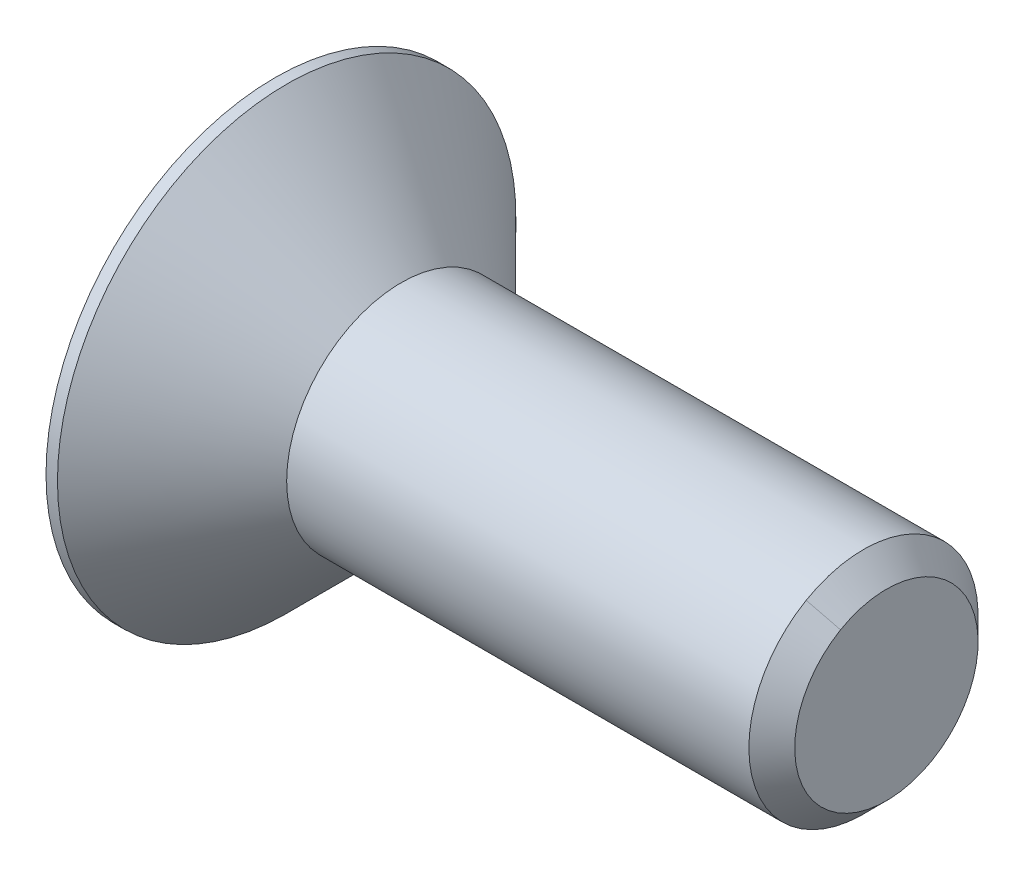
ISO-10303-21;
HEADER;
FILE_DESCRIPTION(('STEP AP214'),'2;1');
FILE_NAME('part.step','',(''),(''),'','','');
FILE_SCHEMA(('AUTOMOTIVE_DESIGN { 1 0 10303 214 1 1 1 1 }'));
ENDSEC;
DATA;
#1=APPLICATION_CONTEXT('core data for automotive mechanical design processes');
#2=APPLICATION_PROTOCOL_DEFINITION('international standard','automotive_design',2000,#1);
#3=PRODUCT_CONTEXT('',#1,'mechanical');
#4=PRODUCT('Part','Part','',(#3));
#5=PRODUCT_RELATED_PRODUCT_CATEGORY('part','',(#4));
#6=PRODUCT_DEFINITION_FORMATION('','',#4);
#7=PRODUCT_DEFINITION_CONTEXT('part definition',#1,'design');
#8=PRODUCT_DEFINITION('design','',#6,#7);
#9=PRODUCT_DEFINITION_SHAPE('','',#8);
#10=(LENGTH_UNIT() NAMED_UNIT(*) SI_UNIT(.MILLI.,.METRE.));
#11=(NAMED_UNIT(*) PLANE_ANGLE_UNIT() SI_UNIT($,.RADIAN.));
#12=(NAMED_UNIT(*) SI_UNIT($,.STERADIAN.) SOLID_ANGLE_UNIT());
#13=UNCERTAINTY_MEASURE_WITH_UNIT(LENGTH_MEASURE(1.E-05),#10,'distance_accuracy_value','');
#14=(GEOMETRIC_REPRESENTATION_CONTEXT(3) GLOBAL_UNCERTAINTY_ASSIGNED_CONTEXT((#13)) GLOBAL_UNIT_ASSIGNED_CONTEXT((#10,
#11,#12)) REPRESENTATION_CONTEXT('',''));
#15=CARTESIAN_POINT('',(0.,0.,0.));
#16=DIRECTION('',(0.,0.,1.));
#17=DIRECTION('',(1.,0.,0.));
#18=AXIS2_PLACEMENT_3D('',#15,#16,#17);
#19=CARTESIAN_POINT('',(1.64999999999879,-32.4759526468396,18.7500007598758));
#20=DIRECTION('',(-1.,0.,0.));
#21=DIRECTION('',(0.,0.,1.));
#22=AXIS2_PLACEMENT_3D('',#19,#20,#21);
#23=PLANE('',#22);
#24=DIRECTION('',(0.,0.500000000000001,0.866025403784438));
#25=VECTOR('',#24,1.);
#26=CARTESIAN_POINT('',(1.64999999999884,-30.7439018392706,17.7500007598758));
#27=LINE('',#26,#25);
#28=CARTESIAN_POINT('',(1.64999999999885,-30.166551570081,18.7500007598758));
#29=VERTEX_POINT('',#28);
#30=CARTESIAN_POINT('',(1.64999999999877,-31.3212521084603,16.7500007598758));
#31=VERTEX_POINT('',#30);
#32=EDGE_CURVE('E106',#29,#31,#27,.F.);
#33=ORIENTED_EDGE('',*,*,#32,.T.);
#34=DIRECTION('',(0.,1.,0.));
#35=VECTOR('',#34,1.);
#36=CARTESIAN_POINT('',(1.64999999999875,-32.4759526468395,16.7500007598757));
#37=LINE('',#36,#35);
#38=CARTESIAN_POINT('',(1.64999999999872,-33.6306531852188,16.7500007598758));
#39=VERTEX_POINT('',#38);
#40=EDGE_CURVE('E101',#31,#39,#37,.F.);
#41=ORIENTED_EDGE('',*,*,#40,.T.);
#42=DIRECTION('',(0.,0.499999999999999,-0.866025403784439));
#43=VECTOR('',#42,1.);
#44=CARTESIAN_POINT('',(1.64999999999871,-34.2080034544084,17.7500007598758));
#45=LINE('',#44,#43);
#46=CARTESIAN_POINT('',(1.64999999999873,-34.7853537235981,18.7500007598758));
#47=VERTEX_POINT('',#46);
#48=EDGE_CURVE('E97',#39,#47,#45,.F.);
#49=ORIENTED_EDGE('',*,*,#48,.T.);
#50=DIRECTION('',(0.,-0.500000000000001,-0.866025403784438));
#51=VECTOR('',#50,1.);
#52=CARTESIAN_POINT('',(1.64999999999875,-34.2080034544084,19.7500007598758));
#53=LINE('',#52,#51);
#54=CARTESIAN_POINT('',(1.64999999999882,-33.6306531852188,20.7500007598758));
#55=VERTEX_POINT('',#54);
#56=EDGE_CURVE('E124',#47,#55,#53,.F.);
#57=ORIENTED_EDGE('',*,*,#56,.T.);
#58=DIRECTION('',(0.,1.,0.));
#59=VECTOR('',#58,1.);
#60=CARTESIAN_POINT('',(1.64999999999884,-32.4759526468395,20.7500007598757));
#61=LINE('',#60,#59);
#62=CARTESIAN_POINT('',(1.64999999999887,-31.3212521084603,20.7500007598758));
#63=VERTEX_POINT('',#62);
#64=EDGE_CURVE('E116',#55,#63,#61,.T.);
#65=ORIENTED_EDGE('',*,*,#64,.T.);
#66=DIRECTION('',(0.,-0.499999999999999,0.866025403784439));
#67=VECTOR('',#66,1.);
#68=CARTESIAN_POINT('',(1.64999999999888,-30.7439018392706,19.7500007598758));
#69=LINE('',#68,#67);
#70=EDGE_CURVE('E111',#63,#29,#69,.F.);
#71=ORIENTED_EDGE('',*,*,#70,.T.);
#72=EDGE_LOOP('',(#33,#41,#49,#57,#65,#71));
#73=FACE_BOUND('',#72,.T.);
#74=ADVANCED_FACE('F17',(#73),#23,.T.);
#75=CARTESIAN_POINT('',(-1.27284774832294E-12,-34.2080034544084,17.7500007598758));
#76=DIRECTION('',(0.,-0.866025403784439,-0.499999999999999));
#77=DIRECTION('',(0.,0.499999999999999,-0.866025403784439));
#78=AXIS2_PLACEMENT_3D('',#75,#76,#77);
#79=PLANE('',#78);
#80=DIRECTION('',(-1.,0.,0.));
#81=VECTOR('',#80,1.);
#82=CARTESIAN_POINT('',(-1.27272528768756E-12,-33.6306531852188,16.7500007598758));
#83=LINE('',#82,#81);
#84=CARTESIAN_POINT('',(-1.27284774832294E-12,-33.6306531852188,16.7500007598758));
#85=VERTEX_POINT('',#84);
#86=EDGE_CURVE('E99',#39,#85,#83,.T.);
#87=ORIENTED_EDGE('',*,*,#86,.T.);
#88=DIRECTION('',(0.,0.499999999999984,-0.866025403784448));
#89=VECTOR('',#88,1.);
#90=CARTESIAN_POINT('',(-1.25131056623544E-12,-34.785353723598,18.7500007598758));
#91=LINE('',#90,#89);
#92=CARTESIAN_POINT('',(-1.22971215383026E-12,-34.785353723598,18.7500007598758));
#93=VERTEX_POINT('',#92);
#94=EDGE_CURVE('E127',#93,#85,#91,.T.);
#95=ORIENTED_EDGE('',*,*,#94,.F.);
#96=DIRECTION('',(1.,0.,0.));
#97=VECTOR('',#96,1.);
#98=CARTESIAN_POINT('',(-1.20811374142507E-12,-34.785353723598,18.7500007598758));
#99=LINE('',#98,#97);
#100=EDGE_CURVE('E121',#93,#47,#99,.T.);
#101=ORIENTED_EDGE('',*,*,#100,.T.);
#102=ORIENTED_EDGE('',*,*,#48,.F.);
#103=EDGE_LOOP('',(#87,#95,#101,#102));
#104=FACE_BOUND('',#103,.T.);
#105=ADVANCED_FACE('F177',(#104),#79,.F.);
#106=CARTESIAN_POINT('',(-1.27272528768756E-12,-32.4759526468395,16.7500007598758));
#107=DIRECTION('',(0.,0.,-1.));
#108=DIRECTION('',(-1.,0.,0.));
#109=AXIS2_PLACEMENT_3D('',#106,#107,#108);
#110=PLANE('',#109);
#111=DIRECTION('',(1.,0.,0.));
#112=VECTOR('',#111,1.);
#113=CARTESIAN_POINT('',(-1.20786882015431E-12,-31.3212521084602,16.7500007598758));
#114=LINE('',#113,#112);
#115=CARTESIAN_POINT('',(-1.27272528768756E-12,-31.3212521084603,16.7500007598758));
#116=VERTEX_POINT('',#115);
#117=EDGE_CURVE('E104',#31,#116,#114,.F.);
#118=ORIENTED_EDGE('',*,*,#117,.T.);
#119=DIRECTION('',(0.,1.,0.));
#120=VECTOR('',#119,1.);
#121=CARTESIAN_POINT('',(-1.22399109156108E-12,-29.8778764354862,16.7500007598758));
#122=LINE('',#121,#120);
#123=EDGE_CURVE('E132',#85,#116,#122,.T.);
#124=ORIENTED_EDGE('',*,*,#123,.F.);
#125=ORIENTED_EDGE('',*,*,#86,.F.);
#126=ORIENTED_EDGE('',*,*,#40,.F.);
#127=EDGE_LOOP('',(#118,#124,#125,#126));
#128=FACE_BOUND('',#127,.T.);
#129=ADVANCED_FACE('F182',(#128),#110,.F.);
#130=CARTESIAN_POINT('',(-1.20786882015431E-12,-30.7439018392706,17.7500007598758));
#131=DIRECTION('',(0.,0.866025403784438,-0.500000000000001));
#132=DIRECTION('',(0.,0.500000000000001,0.866025403784438));
#133=AXIS2_PLACEMENT_3D('',#130,#131,#132);
#134=PLANE('',#133);
#135=DIRECTION('',(1.,0.,0.));
#136=VECTOR('',#135,1.);
#137=CARTESIAN_POINT('',(-1.14313481325644E-12,-30.166551570081,18.7500007598759));
#138=LINE('',#137,#136);
#139=CARTESIAN_POINT('',(-1.20786882015431E-12,-30.166551570081,18.7500007598758));
#140=VERTEX_POINT('',#139);
#141=EDGE_CURVE('E109',#29,#140,#138,.F.);
#142=ORIENTED_EDGE('',*,*,#141,.T.);
#143=DIRECTION('',(0.,0.500000000000014,0.866025403784431));
#144=VECTOR('',#143,1.);
#145=CARTESIAN_POINT('',(-1.25106564496468E-12,-31.3212521084603,16.7500007598758));
#146=LINE('',#145,#144);
#147=EDGE_CURVE('E135',#116,#140,#146,.T.);
#148=ORIENTED_EDGE('',*,*,#147,.F.);
#149=ORIENTED_EDGE('',*,*,#117,.F.);
#150=ORIENTED_EDGE('',*,*,#32,.F.);
#151=EDGE_LOOP('',(#142,#148,#149,#150));
#152=FACE_BOUND('',#151,.T.);
#153=ADVANCED_FACE('F185',(#152),#134,.F.);
#154=CARTESIAN_POINT('',(-1.14313481325644E-12,-30.7439018392706,19.7500007598758));
#155=DIRECTION('',(0.,0.866025403784439,0.499999999999999));
#156=DIRECTION('',(0.,-0.499999999999999,0.866025403784439));
#157=AXIS2_PLACEMENT_3D('',#154,#155,#156);
#158=PLANE('',#157);
#159=DIRECTION('',(1.,0.,0.));
#160=VECTOR('',#159,1.);
#161=CARTESIAN_POINT('',(-1.14325727389182E-12,-31.3212521084603,20.7500007598758));
#162=LINE('',#161,#160);
#163=CARTESIAN_POINT('',(-1.14313481325643E-12,-31.3212521084603,20.7500007598758));
#164=VERTEX_POINT('',#163);
#165=EDGE_CURVE('E114',#63,#164,#162,.F.);
#166=ORIENTED_EDGE('',*,*,#165,.T.);
#167=DIRECTION('',(0.,-0.500000000000014,0.86602540378443));
#168=VECTOR('',#167,1.);
#169=CARTESIAN_POINT('',(-1.16467199534393E-12,-30.166551570081,18.7500007598758));
#170=LINE('',#169,#168);
#171=EDGE_CURVE('E138',#140,#164,#170,.T.);
#172=ORIENTED_EDGE('',*,*,#171,.F.);
#173=ORIENTED_EDGE('',*,*,#141,.F.);
#174=ORIENTED_EDGE('',*,*,#70,.F.);
#175=EDGE_LOOP('',(#166,#172,#173,#174));
#176=FACE_BOUND('',#175,.T.);
#177=ADVANCED_FACE('F188',(#176),#158,.F.);
#178=CARTESIAN_POINT('',(-1.14325727389182E-12,-32.4759526468395,20.7500007598758));
#179=DIRECTION('',(0.,0.,1.));
#180=DIRECTION('',(1.,0.,0.));
#181=AXIS2_PLACEMENT_3D('',#178,#179,#180);
#182=PLANE('',#181);
#183=DIRECTION('',(1.,0.,0.));
#184=VECTOR('',#183,1.);
#185=CARTESIAN_POINT('',(-1.20811374142507E-12,-33.6306531852188,20.7500007598758));
#186=LINE('',#185,#184);
#187=CARTESIAN_POINT('',(-1.14325727389182E-12,-33.6306531852188,20.7500007598758));
#188=VERTEX_POINT('',#187);
#189=EDGE_CURVE('E119',#55,#188,#186,.F.);
#190=ORIENTED_EDGE('',*,*,#189,.T.);
#191=DIRECTION('',(0.,1.,0.));
#192=VECTOR('',#191,1.);
#193=CARTESIAN_POINT('',(-1.09452307776534E-12,-29.8778764354862,20.7500007598758));
#194=LINE('',#193,#192);
#195=EDGE_CURVE('E141',#164,#188,#194,.F.);
#196=ORIENTED_EDGE('',*,*,#195,.F.);
#197=ORIENTED_EDGE('',*,*,#165,.F.);
#198=ORIENTED_EDGE('',*,*,#64,.F.);
#199=EDGE_LOOP('',(#190,#196,#197,#198));
#200=FACE_BOUND('',#199,.T.);
#201=ADVANCED_FACE('F171',(#200),#182,.F.);
#202=CARTESIAN_POINT('',(-1.20811374142507E-12,-34.2080034544084,19.7500007598758));
#203=DIRECTION('',(0.,-0.866025403784438,0.500000000000001));
#204=DIRECTION('',(0.,-0.500000000000001,-0.866025403784438));
#205=AXIS2_PLACEMENT_3D('',#202,#203,#204);
#206=PLANE('',#205);
#207=ORIENTED_EDGE('',*,*,#100,.F.);
#208=DIRECTION('',(0.,-0.499999999999985,-0.866025403784447));
#209=VECTOR('',#208,1.);
#210=CARTESIAN_POINT('',(-1.1649169166147E-12,-33.6306531852188,20.7500007598758));
#211=LINE('',#210,#209);
#212=EDGE_CURVE('E144',#188,#93,#211,.T.);
#213=ORIENTED_EDGE('',*,*,#212,.F.);
#214=ORIENTED_EDGE('',*,*,#189,.F.);
#215=ORIENTED_EDGE('',*,*,#56,.F.);
#216=EDGE_LOOP('',(#207,#213,#214,#215));
#217=FACE_BOUND('',#216,.T.);
#218=ADVANCED_FACE('F164',(#217),#206,.F.);
#219=CARTESIAN_POINT('',(-1.11070657948981E-12,-29.8778764354862,20.2500007598758));
#220=DIRECTION('',(-1.,0.,0.));
#221=DIRECTION('',(0.,0.,1.));
#222=AXIS2_PLACEMENT_3D('',#219,#220,#221);
#223=PLANE('',#222);
#224=CARTESIAN_POINT('',(-1.20793674542041E-12,-32.4759526468395,18.7500007598758));
#225=DIRECTION('',(-1.,0.,0.));
#226=DIRECTION('',(0.,0.,1.));
#227=AXIS2_PLACEMENT_3D('',#224,#225,#226);
#228=CIRCLE('',#227,6.);
#229=CARTESIAN_POINT('',(-1.01376903972556E-12,-32.4759526468395,24.7500007598758));
#230=VERTEX_POINT('',#229);
#231=EDGE_CURVE('E20',#230,#230,#228,.F.);
#232=ORIENTED_EDGE('',*,*,#231,.F.);
#233=EDGE_LOOP('',(#232));
#234=FACE_BOUND('',#233,.T.);
#235=ORIENTED_EDGE('',*,*,#195,.T.);
#236=ORIENTED_EDGE('',*,*,#212,.T.);
#237=ORIENTED_EDGE('',*,*,#94,.T.);
#238=ORIENTED_EDGE('',*,*,#123,.T.);
#239=ORIENTED_EDGE('',*,*,#147,.T.);
#240=ORIENTED_EDGE('',*,*,#171,.T.);
#241=EDGE_LOOP('',(#235,#236,#237,#238,#239,#240));
#242=FACE_BOUND('',#241,.T.);
#243=ADVANCED_FACE('F161',(#234,#242),#223,.T.);
#244=CARTESIAN_POINT('',(0.149999999998793,-32.4759526468395,18.7500007598758));
#245=DIRECTION('',(-1.,0.,0.));
#246=DIRECTION('',(0.,0.,1.));
#247=AXIS2_PLACEMENT_3D('',#244,#245,#246);
#248=CYLINDRICAL_SURFACE('',#247,6.);
#249=ORIENTED_EDGE('',*,*,#231,.T.);
#250=EDGE_LOOP('',(#249));
#251=FACE_BOUND('',#250,.T.);
#252=CARTESIAN_POINT('',(0.299999999981343,-32.4759526468396,18.7500007598758));
#253=DIRECTION('',(-1.,0.,0.));
#254=DIRECTION('',(0.,0.866025403785194,0.499999999998693));
#255=AXIS2_PLACEMENT_3D('',#252,#253,#254);
#256=CIRCLE('',#255,6.00000000002418);
#257=CARTESIAN_POINT('',(0.299999999981537,-27.2798002241075,21.7500007598801));
#258=VERTEX_POINT('',#257);
#259=EDGE_CURVE('E90',#258,#258,#256,.F.);
#260=ORIENTED_EDGE('',*,*,#259,.F.);
#261=EDGE_LOOP('',(#260));
#262=FACE_BOUND('',#261,.T.);
#263=ADVANCED_FACE('F158',(#251,#262),#248,.T.);
#264=CARTESIAN_POINT('',(15.4000000000566,-32.4759526468398,18.7500007598753));
#265=DIRECTION('',(-1.,0.,0.));
#266=DIRECTION('',(0.,0.,1.));
#267=AXIS2_PLACEMENT_3D('',#264,#265,#266);
#268=CONICAL_SURFACE('',#267,2.999999999925,0.785398163404765);
#269=DIRECTION('',(0.707106781186525,-0.612372435697453,-0.353553390590447));
#270=VECTOR('',#269,1.);
#271=CARTESIAN_POINT('',(-498999.999999968,432130.135404374,249527.949998757));
#272=LINE('',#271,#270);
#273=CARTESIAN_POINT('',(15.4000000000565,-29.8778764355916,20.2500007598871));
#274=VERTEX_POINT('',#273);
#275=CARTESIAN_POINT('',(15.9999999999323,-30.3974916777378,19.9500007599436));
#276=VERTEX_POINT('',#275);
#277=EDGE_CURVE('E80',#274,#276,#272,.T.);
#278=ORIENTED_EDGE('',*,*,#277,.T.);
#279=CARTESIAN_POINT('',(15.9999999999607,-32.4759526468398,18.7500007598753));
#280=DIRECTION('',(-1.,0.,0.));
#281=DIRECTION('',(0.,0.,1.));
#282=AXIS2_PLACEMENT_3D('',#279,#280,#281);
#283=CIRCLE('',#282,2.40000000001208);
#284=CARTESIAN_POINT('',(16.0000000000186,-34.5544136158911,17.5500007598745));
#285=VERTEX_POINT('',#284);
#286=EDGE_CURVE('E83',#285,#276,#283,.F.);
#287=ORIENTED_EDGE('',*,*,#286,.F.);
#288=DIRECTION('',(0.707106781186571,0.612372435695782,0.35355339059325));
#289=VECTOR('',#288,1.);
#290=CARTESIAN_POINT('',(-499000.,-432195.087308488,-249490.449999215));
#291=LINE('',#290,#289);
#292=CARTESIAN_POINT('',(15.400000000018,-35.0740288581617,17.2500007598709));
#293=VERTEX_POINT('',#292);
#294=EDGE_CURVE('E35',#285,#293,#291,.F.);
#295=ORIENTED_EDGE('',*,*,#294,.T.);
#296=CARTESIAN_POINT('',(15.3999999999988,-32.4759526468398,18.7500007598753));
#297=DIRECTION('',(-1.,0.,0.));
#298=DIRECTION('',(0.,0.,1.));
#299=AXIS2_PLACEMENT_3D('',#296,#297,#298);
#300=CIRCLE('',#299,3.);
#301=EDGE_CURVE('E85',#274,#293,#300,.T.);
#302=ORIENTED_EDGE('',*,*,#301,.F.);
#303=EDGE_LOOP('',(#278,#287,#295,#302));
#304=FACE_BOUND('',#303,.T.);
#305=ADVANCED_FACE('F82',(#304),#268,.T.);
#306=CARTESIAN_POINT('',(15.9999999999988,-31.1769145411632,19.5000007598753));
#307=DIRECTION('',(1.,0.,0.));
#308=DIRECTION('',(0.,0.,-1.));
#309=AXIS2_PLACEMENT_3D('',#306,#307,#308);
#310=PLANE('',#309);
#311=ORIENTED_EDGE('',*,*,#286,.T.);
#312=CARTESIAN_POINT('',(15.9999999999629,-32.4759526468398,18.7500007598753));
#313=DIRECTION('',(-1.,0.,0.));
#314=DIRECTION('',(0.,0.,1.));
#315=AXIS2_PLACEMENT_3D('',#312,#313,#314);
#316=CIRCLE('',#315,2.40000000006018);
#317=EDGE_CURVE('E89',#285,#276,#316,.T.);
#318=ORIENTED_EDGE('',*,*,#317,.F.);
#319=EDGE_LOOP('',(#311,#318));
#320=FACE_BOUND('',#319,.T.);
#321=ADVANCED_FACE('F88',(#320),#310,.T.);
#322=CARTESIAN_POINT('',(0.299999999981343,-32.4759526468396,18.7500007598758));
#323=DIRECTION('',(-1.,0.,0.));
#324=DIRECTION('',(0.,0.,1.));
#325=AXIS2_PLACEMENT_3D('',#322,#323,#324);
#326=CONICAL_SURFACE('',#325,6.00000000002418,0.785398163404945);
#327=ORIENTED_EDGE('',*,*,#259,.T.);
#328=EDGE_LOOP('',(#327));
#329=FACE_BOUND('',#328,.T.);
#330=CARTESIAN_POINT('',(3.29999999999879,-32.4759526468396,18.7500007598757));
#331=DIRECTION('',(-1.,0.,0.));
#332=DIRECTION('',(0.,0.,1.));
#333=AXIS2_PLACEMENT_3D('',#330,#331,#332);
#334=CIRCLE('',#333,3.);
#335=CARTESIAN_POINT('',(3.29999999999889,-32.4759526468396,21.7500007598757));
#336=VERTEX_POINT('',#335);
#337=EDGE_CURVE('E26',#336,#336,#334,.F.);
#338=ORIENTED_EDGE('',*,*,#337,.F.);
#339=EDGE_LOOP('',(#338));
#340=FACE_BOUND('',#339,.T.);
#341=ADVANCED_FACE('F202',(#329,#340),#326,.T.);
#342=CARTESIAN_POINT('',(15.4000000000566,-32.4759526468398,18.7500007598753));
#343=DIRECTION('',(-1.,0.,0.));
#344=DIRECTION('',(0.,0.,1.));
#345=AXIS2_PLACEMENT_3D('',#342,#343,#344);
#346=CONICAL_SURFACE('',#345,2.999999999925,0.785398163362891);
#347=ORIENTED_EDGE('',*,*,#277,.F.);
#348=CARTESIAN_POINT('',(15.3999999999988,-32.4759526468398,18.7500007598753));
#349=DIRECTION('',(-1.,0.,0.));
#350=DIRECTION('',(0.,0.,1.));
#351=AXIS2_PLACEMENT_3D('',#348,#349,#350);
#352=CIRCLE('',#351,3.);
#353=EDGE_CURVE('E11',#293,#274,#352,.T.);
#354=ORIENTED_EDGE('',*,*,#353,.F.);
#355=ORIENTED_EDGE('',*,*,#294,.F.);
#356=ORIENTED_EDGE('',*,*,#317,.T.);
#357=EDGE_LOOP('',(#347,#354,#355,#356));
#358=FACE_BOUND('',#357,.T.);
#359=ADVANCED_FACE('F91',(#358),#346,.T.);
#360=CARTESIAN_POINT('',(9.64999999999879,-32.4759526468397,18.7500007598755));
#361=DIRECTION('',(-1.,0.,0.));
#362=DIRECTION('',(0.,0.,1.));
#363=AXIS2_PLACEMENT_3D('',#360,#361,#362);
#364=CYLINDRICAL_SURFACE('',#363,3.);
#365=ORIENTED_EDGE('',*,*,#337,.T.);
#366=EDGE_LOOP('',(#365));
#367=FACE_BOUND('',#366,.T.);
#368=ORIENTED_EDGE('',*,*,#353,.T.);
#369=ORIENTED_EDGE('',*,*,#301,.T.);
#370=EDGE_LOOP('',(#368,#369));
#371=FACE_BOUND('',#370,.T.);
#372=ADVANCED_FACE('F195',(#367,#371),#364,.T.);
#373=CLOSED_SHELL('',(#74,#105,#129,#153,#177,#201,#218,#243,#263,#305,#321,#341,#359,#372));
#374=MANIFOLD_SOLID_BREP('B1',#373);
#375=ADVANCED_BREP_SHAPE_REPRESENTATION('',(#18,#374),#14);
#376=SHAPE_DEFINITION_REPRESENTATION(#9,#375);
ENDSEC;
END-ISO-10303-21;
